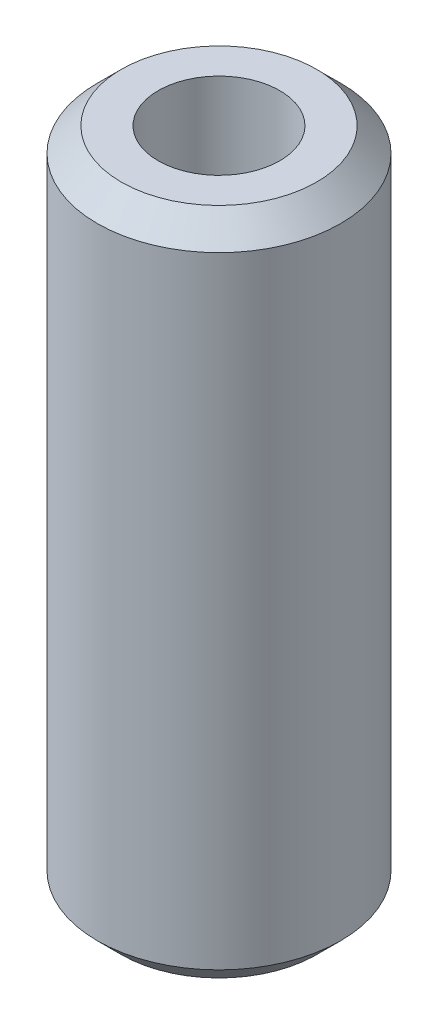
ISO-10303-21;
HEADER;
FILE_DESCRIPTION(('STEP AP214'),'2;1');
FILE_NAME('part.step','',(''),(''),'','','');
FILE_SCHEMA(('AUTOMOTIVE_DESIGN { 1 0 10303 214 1 1 1 1 }'));
ENDSEC;
DATA;
#1=APPLICATION_CONTEXT('core data for automotive mechanical design processes');
#2=APPLICATION_PROTOCOL_DEFINITION('international standard','automotive_design',2000,#1);
#3=PRODUCT_CONTEXT('',#1,'mechanical');
#4=PRODUCT('Part','Part','',(#3));
#5=PRODUCT_RELATED_PRODUCT_CATEGORY('part','',(#4));
#6=PRODUCT_DEFINITION_FORMATION('','',#4);
#7=PRODUCT_DEFINITION_CONTEXT('part definition',#1,'design');
#8=PRODUCT_DEFINITION('design','',#6,#7);
#9=PRODUCT_DEFINITION_SHAPE('','',#8);
#10=(LENGTH_UNIT() NAMED_UNIT(*) SI_UNIT(.MILLI.,.METRE.));
#11=(NAMED_UNIT(*) PLANE_ANGLE_UNIT() SI_UNIT($,.RADIAN.));
#12=(NAMED_UNIT(*) SI_UNIT($,.STERADIAN.) SOLID_ANGLE_UNIT());
#13=UNCERTAINTY_MEASURE_WITH_UNIT(LENGTH_MEASURE(1.E-05),#10,'distance_accuracy_value','');
#14=(GEOMETRIC_REPRESENTATION_CONTEXT(3) GLOBAL_UNCERTAINTY_ASSIGNED_CONTEXT((#13)) GLOBAL_UNIT_ASSIGNED_CONTEXT((#10,
#11,#12)) REPRESENTATION_CONTEXT('',''));
#15=CARTESIAN_POINT('',(0.,0.,0.));
#16=DIRECTION('',(0.,0.,1.));
#17=DIRECTION('',(1.,0.,0.));
#18=AXIS2_PLACEMENT_3D('',#15,#16,#17);
#19=CARTESIAN_POINT('',(0.,34.925,0.));
#20=DIRECTION('',(0.,1.,0.));
#21=DIRECTION('',(0.,0.,1.));
#22=AXIS2_PLACEMENT_3D('',#19,#20,#21);
#23=PLANE('',#22);
#24=CARTESIAN_POINT('',(0.,34.925,0.));
#25=DIRECTION('',(0.,1.,0.));
#26=DIRECTION('',(0.,0.,1.));
#27=AXIS2_PLACEMENT_3D('',#24,#25,#26);
#28=CIRCLE('',#27,10.2);
#29=CARTESIAN_POINT('',(0.,34.925,10.2));
#30=VERTEX_POINT('',#29);
#31=EDGE_CURVE('E10',#30,#30,#28,.T.);
#32=ORIENTED_EDGE('',*,*,#31,.T.);
#33=EDGE_LOOP('',(#32));
#34=FACE_BOUND('',#33,.T.);
#35=CARTESIAN_POINT('',(0.,34.925,0.));
#36=DIRECTION('',(0.,1.,0.));
#37=DIRECTION('',(0.,0.,1.));
#38=AXIS2_PLACEMENT_3D('',#35,#36,#37);
#39=CIRCLE('',#38,6.35);
#40=CARTESIAN_POINT('',(0.,34.925,6.35));
#41=VERTEX_POINT('',#40);
#42=EDGE_CURVE('E60',#41,#41,#39,.T.);
#43=ORIENTED_EDGE('',*,*,#42,.F.);
#44=EDGE_LOOP('',(#43));
#45=FACE_BOUND('',#44,.T.);
#46=ADVANCED_FACE('F39',(#34,#45),#23,.T.);
#47=CARTESIAN_POINT('',(0.,-34.925,0.));
#48=DIRECTION('',(0.,1.,0.));
#49=DIRECTION('',(0.,0.,1.));
#50=AXIS2_PLACEMENT_3D('',#47,#48,#49);
#51=PLANE('',#50);
#52=CARTESIAN_POINT('',(0.,-34.925,0.));
#53=DIRECTION('',(0.,1.,0.));
#54=DIRECTION('',(0.,0.,1.));
#55=AXIS2_PLACEMENT_3D('',#52,#53,#54);
#56=CIRCLE('',#55,10.2);
#57=CARTESIAN_POINT('',(0.,-34.925,10.2));
#58=VERTEX_POINT('',#57);
#59=EDGE_CURVE('E47',#58,#58,#56,.F.);
#60=ORIENTED_EDGE('',*,*,#59,.T.);
#61=EDGE_LOOP('',(#60));
#62=FACE_BOUND('',#61,.T.);
#63=CARTESIAN_POINT('',(0.,-34.925,0.));
#64=DIRECTION('',(0.,1.,0.));
#65=DIRECTION('',(0.,0.,1.));
#66=AXIS2_PLACEMENT_3D('',#63,#64,#65);
#67=CIRCLE('',#66,6.35);
#68=CARTESIAN_POINT('',(0.,-34.925,6.35));
#69=VERTEX_POINT('',#68);
#70=EDGE_CURVE('E61',#69,#69,#67,.T.);
#71=ORIENTED_EDGE('',*,*,#70,.T.);
#72=EDGE_LOOP('',(#71));
#73=FACE_BOUND('',#72,.T.);
#74=ADVANCED_FACE('F71',(#62,#73),#51,.F.);
#75=CARTESIAN_POINT('',(0.,34.925,0.));
#76=DIRECTION('',(0.,-1.,0.));
#77=DIRECTION('',(0.,0.,-1.));
#78=AXIS2_PLACEMENT_3D('',#75,#76,#77);
#79=CYLINDRICAL_SURFACE('',#78,12.7);
#80=CARTESIAN_POINT('',(0.,-32.425,0.));
#81=DIRECTION('',(0.,1.,0.));
#82=DIRECTION('',(0.,0.,1.));
#83=AXIS2_PLACEMENT_3D('',#80,#81,#82);
#84=CIRCLE('',#83,12.7);
#85=CARTESIAN_POINT('',(0.,-32.425,12.7));
#86=VERTEX_POINT('',#85);
#87=EDGE_CURVE('E51',#86,#86,#84,.T.);
#88=ORIENTED_EDGE('',*,*,#87,.T.);
#89=EDGE_LOOP('',(#88));
#90=FACE_BOUND('',#89,.T.);
#91=CARTESIAN_POINT('',(0.,32.425,0.));
#92=DIRECTION('',(0.,1.,0.));
#93=DIRECTION('',(0.,0.,1.));
#94=AXIS2_PLACEMENT_3D('',#91,#92,#93);
#95=CIRCLE('',#94,12.7);
#96=CARTESIAN_POINT('',(0.,32.425,12.7));
#97=VERTEX_POINT('',#96);
#98=EDGE_CURVE('E55',#97,#97,#95,.F.);
#99=ORIENTED_EDGE('',*,*,#98,.T.);
#100=EDGE_LOOP('',(#99));
#101=FACE_BOUND('',#100,.T.);
#102=ADVANCED_FACE('F77',(#90,#101),#79,.T.);
#103=CARTESIAN_POINT('',(0.,34.925,0.));
#104=DIRECTION('',(0.,-1.,0.));
#105=DIRECTION('',(0.,0.,-1.));
#106=AXIS2_PLACEMENT_3D('',#103,#104,#105);
#107=CYLINDRICAL_SURFACE('',#106,6.35);
#108=ORIENTED_EDGE('',*,*,#42,.T.);
#109=EDGE_LOOP('',(#108));
#110=FACE_BOUND('',#109,.T.);
#111=ORIENTED_EDGE('',*,*,#70,.F.);
#112=EDGE_LOOP('',(#111));
#113=FACE_BOUND('',#112,.T.);
#114=ADVANCED_FACE('F67',(#110,#113),#107,.F.);
#115=CARTESIAN_POINT('',(0.,-32.425,0.));
#116=DIRECTION('',(0.,1.,0.));
#117=DIRECTION('',(0.,0.,1.));
#118=AXIS2_PLACEMENT_3D('',#115,#116,#117);
#119=CONICAL_SURFACE('',#118,12.7,0.785398163397449);
#120=ORIENTED_EDGE('',*,*,#59,.F.);
#121=EDGE_LOOP('',(#120));
#122=FACE_BOUND('',#121,.T.);
#123=ORIENTED_EDGE('',*,*,#87,.F.);
#124=EDGE_LOOP('',(#123));
#125=FACE_BOUND('',#124,.T.);
#126=ADVANCED_FACE('F84',(#122,#125),#119,.T.);
#127=CARTESIAN_POINT('',(0.,34.925,0.));
#128=DIRECTION('',(0.,-1.,0.));
#129=DIRECTION('',(0.,0.,-1.));
#130=AXIS2_PLACEMENT_3D('',#127,#128,#129);
#131=CONICAL_SURFACE('',#130,10.2,0.785398163397446);
#132=ORIENTED_EDGE('',*,*,#98,.F.);
#133=EDGE_LOOP('',(#132));
#134=FACE_BOUND('',#133,.T.);
#135=ORIENTED_EDGE('',*,*,#31,.F.);
#136=EDGE_LOOP('',(#135));
#137=FACE_BOUND('',#136,.T.);
#138=ADVANCED_FACE('F42',(#134,#137),#131,.T.);
#139=CLOSED_SHELL('',(#46,#74,#102,#114,#126,#138));
#140=MANIFOLD_SOLID_BREP('B2',#139);
#141=ADVANCED_BREP_SHAPE_REPRESENTATION('',(#18,#140),#14);
#142=SHAPE_DEFINITION_REPRESENTATION(#9,#141);
ENDSEC;
END-ISO-10303-21;
